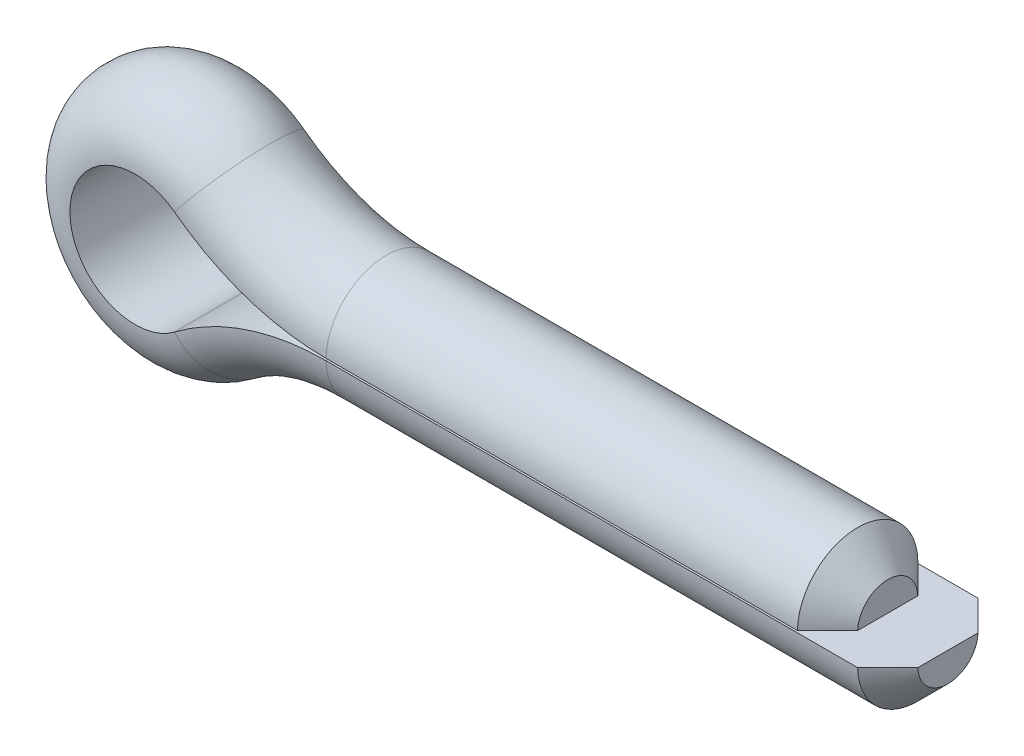
ISO-10303-21;
HEADER;
FILE_DESCRIPTION(('STEP AP214'),'2;1');
FILE_NAME('part.step','',(''),(''),'','','');
FILE_SCHEMA(('AUTOMOTIVE_DESIGN { 1 0 10303 214 1 1 1 1 }'));
ENDSEC;
DATA;
#1=APPLICATION_CONTEXT('core data for automotive mechanical design processes');
#2=APPLICATION_PROTOCOL_DEFINITION('international standard','automotive_design',2000,#1);
#3=PRODUCT_CONTEXT('',#1,'mechanical');
#4=PRODUCT('Part','Part','',(#3));
#5=PRODUCT_RELATED_PRODUCT_CATEGORY('part','',(#4));
#6=PRODUCT_DEFINITION_FORMATION('','',#4);
#7=PRODUCT_DEFINITION_CONTEXT('part definition',#1,'design');
#8=PRODUCT_DEFINITION('design','',#6,#7);
#9=PRODUCT_DEFINITION_SHAPE('','',#8);
#10=(LENGTH_UNIT() NAMED_UNIT(*) SI_UNIT(.MILLI.,.METRE.));
#11=(NAMED_UNIT(*) PLANE_ANGLE_UNIT() SI_UNIT($,.RADIAN.));
#12=(NAMED_UNIT(*) SI_UNIT($,.STERADIAN.) SOLID_ANGLE_UNIT());
#13=UNCERTAINTY_MEASURE_WITH_UNIT(LENGTH_MEASURE(1.E-05),#10,'distance_accuracy_value','');
#14=(GEOMETRIC_REPRESENTATION_CONTEXT(3) GLOBAL_UNCERTAINTY_ASSIGNED_CONTEXT((#13)) GLOBAL_UNIT_ASSIGNED_CONTEXT((#10,
#11,#12)) REPRESENTATION_CONTEXT('',''));
#15=CARTESIAN_POINT('',(0.,0.,0.));
#16=DIRECTION('',(0.,0.,1.));
#17=DIRECTION('',(1.,0.,0.));
#18=AXIS2_PLACEMENT_3D('',#15,#16,#17);
#19=CARTESIAN_POINT('',(1.524,0.,0.));
#20=DIRECTION('',(-1.,0.,0.));
#21=DIRECTION('',(0.,0.,-1.));
#22=AXIS2_PLACEMENT_3D('',#19,#20,#21);
#23=PLANE('',#22);
#24=DIRECTION('',(0.,0.,-1.));
#25=VECTOR('',#24,1.);
#26=CARTESIAN_POINT('',(1.524,-0.0254,1.52378831863222));
#27=LINE('',#26,#25);
#28=CARTESIAN_POINT('',(1.524,-0.0253999999999999,0.761576549008695));
#29=VERTEX_POINT('',#28);
#30=CARTESIAN_POINT('',(1.524,-0.0253999999999998,-0.761576549008695));
#31=VERTEX_POINT('',#30);
#32=EDGE_CURVE('E138',#29,#31,#27,.T.);
#33=ORIENTED_EDGE('',*,*,#32,.F.);
#34=CARTESIAN_POINT('',(1.524,0.,0.));
#35=DIRECTION('',(-1.,0.,0.));
#36=DIRECTION('',(0.,-1.,0.));
#37=AXIS2_PLACEMENT_3D('',#34,#35,#36);
#38=CIRCLE('',#37,0.761999999999996);
#39=EDGE_CURVE('E249',#29,#31,#38,.F.);
#40=ORIENTED_EDGE('',*,*,#39,.T.);
#41=EDGE_LOOP('',(#33,#40));
#42=FACE_BOUND('',#41,.T.);
#43=ADVANCED_FACE('F60',(#42),#23,.F.);
#44=CARTESIAN_POINT('',(0.,0.,0.));
#45=DIRECTION('',(1.,0.,0.));
#46=DIRECTION('',(0.,0.,-1.));
#47=AXIS2_PLACEMENT_3D('',#44,#45,#46);
#48=PLANE('',#47);
#49=DIRECTION('',(0.,0.,-1.));
#50=VECTOR('',#49,1.);
#51=CARTESIAN_POINT('',(0.,0.0254,1.52378831863222));
#52=LINE('',#51,#50);
#53=CARTESIAN_POINT('',(0.,0.0253999999999999,0.761576549008702));
#54=VERTEX_POINT('',#53);
#55=CARTESIAN_POINT('',(0.,0.0253999999999998,-0.761576549008702));
#56=VERTEX_POINT('',#55);
#57=EDGE_CURVE('E185',#54,#56,#52,.T.);
#58=ORIENTED_EDGE('',*,*,#57,.T.);
#59=CARTESIAN_POINT('',(0.,0.,0.));
#60=DIRECTION('',(1.,0.,0.));
#61=DIRECTION('',(0.,0.,-1.));
#62=AXIS2_PLACEMENT_3D('',#59,#60,#61);
#63=CIRCLE('',#62,0.762000000000002);
#64=EDGE_CURVE('E246',#56,#54,#63,.T.);
#65=ORIENTED_EDGE('',*,*,#64,.T.);
#66=EDGE_LOOP('',(#58,#65));
#67=FACE_BOUND('',#66,.T.);
#68=ADVANCED_FACE('F223',(#67),#48,.T.);
#69=CARTESIAN_POINT('',(1.524,0.,0.));
#70=DIRECTION('',(-1.,0.,0.));
#71=DIRECTION('',(0.,-1.,0.));
#72=AXIS2_PLACEMENT_3D('',#69,#70,#71);
#73=CYLINDRICAL_SURFACE('',#72,1.524);
#74=DIRECTION('',(-1.,0.,0.));
#75=VECTOR('',#74,1.);
#76=CARTESIAN_POINT('',(1.524,-0.0253999999999997,-1.52378831863222));
#77=LINE('',#76,#75);
#78=CARTESIAN_POINT('',(0.761999999999994,-0.0253999999999995,-1.52378831863222));
#79=VERTEX_POINT('',#78);
#80=CARTESIAN_POINT('',(-12.7,-0.0253999999999963,-1.52378831863222));
#81=VERTEX_POINT('',#80);
#82=EDGE_CURVE('E123',#79,#81,#77,.T.);
#83=ORIENTED_EDGE('',*,*,#82,.F.);
#84=CARTESIAN_POINT('',(0.761999999999994,0.,0.));
#85=DIRECTION('',(-1.,0.,0.));
#86=DIRECTION('',(0.,-1.,0.));
#87=AXIS2_PLACEMENT_3D('',#84,#85,#86);
#88=CIRCLE('',#87,1.524);
#89=CARTESIAN_POINT('',(0.761999999999994,-0.0253999999999998,1.52378831863222));
#90=VERTEX_POINT('',#89);
#91=EDGE_CURVE('E197',#79,#90,#88,.T.);
#92=ORIENTED_EDGE('',*,*,#91,.T.);
#93=DIRECTION('',(-1.,0.,0.));
#94=VECTOR('',#93,1.);
#95=CARTESIAN_POINT('',(1.524,-0.0254,1.52378831863222));
#96=LINE('',#95,#94);
#97=CARTESIAN_POINT('',(-12.7,-0.0253999999999966,1.52378831863222));
#98=VERTEX_POINT('',#97);
#99=EDGE_CURVE('E154',#90,#98,#96,.T.);
#100=ORIENTED_EDGE('',*,*,#99,.T.);
#101=CARTESIAN_POINT('',(-12.7,0.,0.));
#102=DIRECTION('',(-1.,0.,0.));
#103=DIRECTION('',(0.,0.,-1.));
#104=AXIS2_PLACEMENT_3D('',#101,#102,#103);
#105=CIRCLE('',#104,1.524);
#106=EDGE_CURVE('E137',#81,#98,#105,.T.);
#107=ORIENTED_EDGE('',*,*,#106,.F.);
#108=EDGE_LOOP('',(#83,#92,#100,#107));
#109=FACE_BOUND('',#108,.T.);
#110=ADVANCED_FACE('F156',(#109),#73,.T.);
#111=CARTESIAN_POINT('',(1.524,-0.0254,1.52378831863222));
#112=DIRECTION('',(0.,1.,0.));
#113=DIRECTION('',(-1.,0.,0.));
#114=AXIS2_PLACEMENT_3D('',#111,#112,#113);
#115=PLANE('',#114);
#116=ORIENTED_EDGE('',*,*,#99,.F.);
#117=CARTESIAN_POINT('',(0.761999999999994,-0.0253999999999998,1.52378831863222));
#118=CARTESIAN_POINT('',(0.889011769792723,-0.0253999999999998,1.39676479039933));
#119=CARTESIAN_POINT('',(1.01601765464367,-0.0253999999999999,1.2697353788597));
#120=CARTESIAN_POINT('',(1.27001765464368,-0.0253999999999999,1.01566478898521));
#121=CARTESIAN_POINT('',(1.39701176979274,-0.0253999999999999,0.888623610650329));
#122=CARTESIAN_POINT('',(1.524,-0.0253999999999999,0.761576549008695));
#123=B_SPLINE_CURVE_WITH_KNOTS('',3,(#117,#118,#119,#120,#121,#122),.UNSPECIFIED.,.F.,.F.,(4,2,
4),(0.,0.538890244526547,1.0777804898241),.UNSPECIFIED.);
#124=EDGE_CURVE('E205',#90,#29,#123,.T.);
#125=ORIENTED_EDGE('',*,*,#124,.T.);
#126=ORIENTED_EDGE('',*,*,#32,.T.);
#127=CARTESIAN_POINT('',(1.524,-0.0253999999999998,-0.761576549008695));
#128=CARTESIAN_POINT('',(1.31362474173232,-0.0253999999999997,-0.972042265569015));
#129=CARTESIAN_POINT('',(1.10323623399388,-0.0253999999999996,-1.18249473567864));
#130=CARTESIAN_POINT('',(0.849223553756497,-0.0253999999999995,-1.43655264820608));
#131=CARTESIAN_POINT('',(0.805612061494938,-0.0253999999999995,-1.48017076797097));
#132=CARTESIAN_POINT('',(0.761999999999994,-0.0253999999999995,-1.52378831863222));
#133=B_SPLINE_CURVE_WITH_KNOTS('',3,(#127,#128,#129,#130,#131,#132),.UNSPECIFIED.,.F.,.F.,(4,2,
4),(0.,0.89273853802379,1.07778048911039),.UNSPECIFIED.);
#134=EDGE_CURVE('E132',#31,#79,#133,.T.);
#135=ORIENTED_EDGE('',*,*,#134,.T.);
#136=ORIENTED_EDGE('',*,*,#82,.T.);
#137=DIRECTION('',(0.,0.,-1.));
#138=VECTOR('',#137,1.);
#139=CARTESIAN_POINT('',(-12.7,-0.0253999999999966,1.52378831863222));
#140=LINE('',#139,#138);
#141=EDGE_CURVE('E128',#98,#81,#140,.T.);
#142=ORIENTED_EDGE('',*,*,#141,.F.);
#143=EDGE_LOOP('',(#116,#125,#126,#135,#136,#142));
#144=FACE_BOUND('',#143,.T.);
#145=ADVANCED_FACE('F126',(#144),#115,.T.);
#146=CARTESIAN_POINT('',(-12.7,-6.3754,0.));
#147=DIRECTION('',(0.,0.,1.));
#148=DIRECTION('',(1.,0.,0.));
#149=AXIS2_PLACEMENT_3D('',#146,#147,#148);
#150=TOROIDAL_SURFACE('',#149,6.3754,1.524);
#151=CARTESIAN_POINT('',(-12.7,-6.3754,1.52378831863222));
#152=DIRECTION('',(0.,0.,1.));
#153=DIRECTION('',(0.,1.,0.));
#154=AXIS2_PLACEMENT_3D('',#151,#152,#153);
#155=CIRCLE('',#154,6.35);
#156=CARTESIAN_POINT('',(-16.5367312029918,-1.31555873015873,1.52378831863222));
#157=VERTEX_POINT('',#156);
#158=EDGE_CURVE('E153',#98,#157,#155,.T.);
#159=ORIENTED_EDGE('',*,*,#158,.T.);
#160=CARTESIAN_POINT('',(-16.5520781278038,-1.29531936507936,0.));
#161=DIRECTION('',(-0.796825396825396,-0.604209638266429,0.));
#162=DIRECTION('',(0.,0.,-1.));
#163=AXIS2_PLACEMENT_3D('',#160,#161,#162);
#164=CIRCLE('',#163,1.524);
#165=CARTESIAN_POINT('',(-16.5367312029918,-1.31555873015873,-1.52378831863222));
#166=VERTEX_POINT('',#165);
#167=EDGE_CURVE('E147',#166,#157,#164,.T.);
#168=ORIENTED_EDGE('',*,*,#167,.F.);
#169=CARTESIAN_POINT('',(-12.7,-6.3754,-1.52378831863222));
#170=DIRECTION('',(0.,0.,1.));
#171=DIRECTION('',(0.,1.,0.));
#172=AXIS2_PLACEMENT_3D('',#169,#170,#171);
#173=CIRCLE('',#172,6.35);
#174=EDGE_CURVE('E143',#81,#166,#173,.T.);
#175=ORIENTED_EDGE('',*,*,#174,.F.);
#176=ORIENTED_EDGE('',*,*,#106,.T.);
#177=EDGE_LOOP('',(#159,#168,#175,#176));
#178=FACE_BOUND('',#177,.T.);
#179=ADVANCED_FACE('F145',(#178),#150,.T.);
#180=CARTESIAN_POINT('',(-12.7,-6.3754,0.));
#181=DIRECTION('',(0.,0.,1.));
#182=DIRECTION('',(1.,0.,0.));
#183=AXIS2_PLACEMENT_3D('',#180,#181,#182);
#184=CYLINDRICAL_SURFACE('',#183,6.35);
#185=DIRECTION('',(0.,0.,-1.));
#186=VECTOR('',#185,1.);
#187=CARTESIAN_POINT('',(-16.5367312029918,-1.31555873015873,1.52378831863222));
#188=LINE('',#187,#186);
#189=EDGE_CURVE('E161',#157,#166,#188,.T.);
#190=ORIENTED_EDGE('',*,*,#189,.F.);
#191=ORIENTED_EDGE('',*,*,#158,.F.);
#192=ORIENTED_EDGE('',*,*,#141,.T.);
#193=ORIENTED_EDGE('',*,*,#174,.T.);
#194=EDGE_LOOP('',(#190,#191,#192,#193));
#195=FACE_BOUND('',#194,.T.);
#196=ADVANCED_FACE('F152',(#195),#184,.T.);
#197=CARTESIAN_POINT('',(-17.5342813157697,0.,0.));
#198=DIRECTION('',(0.,0.,-1.));
#199=DIRECTION('',(-1.,0.,0.));
#200=AXIS2_PLACEMENT_3D('',#197,#198,#199);
#201=TOROIDAL_SURFACE('',#200,1.6256,1.524);
#202=CARTESIAN_POINT('',(-17.5342813157697,0.,1.52378831863222));
#203=DIRECTION('',(0.,0.,-1.));
#204=DIRECTION('',(0.604209638266428,-0.796825396825398,0.));
#205=AXIS2_PLACEMENT_3D('',#202,#203,#204);
#206=CIRCLE('',#205,1.651);
#207=CARTESIAN_POINT('',(-16.5367312029918,1.31555873015873,1.52378831863222));
#208=VERTEX_POINT('',#207);
#209=EDGE_CURVE('E166',#157,#208,#206,.T.);
#210=ORIENTED_EDGE('',*,*,#209,.T.);
#211=CARTESIAN_POINT('',(-16.5520781278038,1.29531936507936,0.));
#212=DIRECTION('',(0.796825396825398,-0.604209638266428,0.));
#213=DIRECTION('',(0.,0.,-1.));
#214=AXIS2_PLACEMENT_3D('',#211,#212,#213);
#215=CIRCLE('',#214,1.524);
#216=CARTESIAN_POINT('',(-16.5367312029918,1.31555873015873,-1.52378831863222));
#217=VERTEX_POINT('',#216);
#218=EDGE_CURVE('E163',#217,#208,#215,.T.);
#219=ORIENTED_EDGE('',*,*,#218,.F.);
#220=CARTESIAN_POINT('',(-17.5342813157697,0.,-1.52378831863222));
#221=DIRECTION('',(0.,0.,-1.));
#222=DIRECTION('',(0.604209638266428,-0.796825396825398,0.));
#223=AXIS2_PLACEMENT_3D('',#220,#221,#222);
#224=CIRCLE('',#223,1.651);
#225=EDGE_CURVE('E167',#166,#217,#224,.T.);
#226=ORIENTED_EDGE('',*,*,#225,.F.);
#227=ORIENTED_EDGE('',*,*,#167,.T.);
#228=EDGE_LOOP('',(#210,#219,#226,#227));
#229=FACE_BOUND('',#228,.T.);
#230=ADVANCED_FACE('F293',(#229),#201,.T.);
#231=CARTESIAN_POINT('',(-17.5342813157697,0.,0.));
#232=DIRECTION('',(0.,0.,-1.));
#233=DIRECTION('',(-1.,0.,0.));
#234=AXIS2_PLACEMENT_3D('',#231,#232,#233);
#235=CYLINDRICAL_SURFACE('',#234,1.651);
#236=DIRECTION('',(0.,0.,-1.));
#237=VECTOR('',#236,1.);
#238=CARTESIAN_POINT('',(-16.5367312029918,1.31555873015873,1.52378831863222));
#239=LINE('',#238,#237);
#240=EDGE_CURVE('E170',#208,#217,#239,.T.);
#241=ORIENTED_EDGE('',*,*,#240,.F.);
#242=ORIENTED_EDGE('',*,*,#209,.F.);
#243=ORIENTED_EDGE('',*,*,#189,.T.);
#244=ORIENTED_EDGE('',*,*,#225,.T.);
#245=EDGE_LOOP('',(#241,#242,#243,#244));
#246=FACE_BOUND('',#245,.T.);
#247=ADVANCED_FACE('F285',(#246),#235,.F.);
#248=CARTESIAN_POINT('',(-12.7,6.3754,0.));
#249=DIRECTION('',(0.,0.,1.));
#250=DIRECTION('',(1.,0.,0.));
#251=AXIS2_PLACEMENT_3D('',#248,#249,#250);
#252=TOROIDAL_SURFACE('',#251,6.3754,1.524);
#253=CARTESIAN_POINT('',(-12.7,6.3754,1.52378831863222));
#254=DIRECTION('',(0.,0.,1.));
#255=DIRECTION('',(-0.60420963826643,-0.796825396825396,0.));
#256=AXIS2_PLACEMENT_3D('',#253,#254,#255);
#257=CIRCLE('',#256,6.35);
#258=CARTESIAN_POINT('',(-12.7,0.0253999999999957,1.52378831863222));
#259=VERTEX_POINT('',#258);
#260=EDGE_CURVE('E176',#208,#259,#257,.T.);
#261=ORIENTED_EDGE('',*,*,#260,.T.);
#262=CARTESIAN_POINT('',(-12.7,0.,0.));
#263=DIRECTION('',(1.,0.,0.));
#264=DIRECTION('',(0.,0.,-1.));
#265=AXIS2_PLACEMENT_3D('',#262,#263,#264);
#266=CIRCLE('',#265,1.524);
#267=CARTESIAN_POINT('',(-12.7,0.0253999999999957,-1.52378831863222));
#268=VERTEX_POINT('',#267);
#269=EDGE_CURVE('E173',#268,#259,#266,.T.);
#270=ORIENTED_EDGE('',*,*,#269,.F.);
#271=CARTESIAN_POINT('',(-12.7,6.3754,-1.52378831863222));
#272=DIRECTION('',(0.,0.,1.));
#273=DIRECTION('',(-0.60420963826643,-0.796825396825396,0.));
#274=AXIS2_PLACEMENT_3D('',#271,#272,#273);
#275=CIRCLE('',#274,6.35);
#276=EDGE_CURVE('E177',#217,#268,#275,.T.);
#277=ORIENTED_EDGE('',*,*,#276,.F.);
#278=ORIENTED_EDGE('',*,*,#218,.T.);
#279=EDGE_LOOP('',(#261,#270,#277,#278));
#280=FACE_BOUND('',#279,.T.);
#281=ADVANCED_FACE('F277',(#280),#252,.T.);
#282=CARTESIAN_POINT('',(-12.7,6.3754,0.));
#283=DIRECTION('',(0.,0.,1.));
#284=DIRECTION('',(1.,0.,0.));
#285=AXIS2_PLACEMENT_3D('',#282,#283,#284);
#286=CYLINDRICAL_SURFACE('',#285,6.35);
#287=DIRECTION('',(0.,0.,-1.));
#288=VECTOR('',#287,1.);
#289=CARTESIAN_POINT('',(-12.7,0.0253999999999966,1.52378831863222));
#290=LINE('',#289,#288);
#291=EDGE_CURVE('E180',#259,#268,#290,.T.);
#292=ORIENTED_EDGE('',*,*,#291,.F.);
#293=ORIENTED_EDGE('',*,*,#260,.F.);
#294=ORIENTED_EDGE('',*,*,#240,.T.);
#295=ORIENTED_EDGE('',*,*,#276,.T.);
#296=EDGE_LOOP('',(#292,#293,#294,#295));
#297=FACE_BOUND('',#296,.T.);
#298=ADVANCED_FACE('F232',(#297),#286,.T.);
#299=CARTESIAN_POINT('',(-12.7,0.,0.));
#300=DIRECTION('',(1.,0.,0.));
#301=DIRECTION('',(0.,1.,0.));
#302=AXIS2_PLACEMENT_3D('',#299,#300,#301);
#303=CYLINDRICAL_SURFACE('',#302,1.524);
#304=DIRECTION('',(1.,0.,0.));
#305=VECTOR('',#304,1.);
#306=CARTESIAN_POINT('',(-12.7,0.0253999999999983,1.52378831863222));
#307=LINE('',#306,#305);
#308=CARTESIAN_POINT('',(-0.762000000000001,0.0253999999999999,1.52378831863222));
#309=VERTEX_POINT('',#308);
#310=EDGE_CURVE('E183',#259,#309,#307,.T.);
#311=ORIENTED_EDGE('',*,*,#310,.T.);
#312=CARTESIAN_POINT('',(-0.762000000000001,0.,0.));
#313=DIRECTION('',(1.,0.,0.));
#314=DIRECTION('',(0.,1.,0.));
#315=AXIS2_PLACEMENT_3D('',#312,#313,#314);
#316=CIRCLE('',#315,1.524);
#317=CARTESIAN_POINT('',(-0.762000000000001,0.0253999999999996,-1.52378831863222));
#318=VERTEX_POINT('',#317);
#319=EDGE_CURVE('E12',#309,#318,#316,.F.);
#320=ORIENTED_EDGE('',*,*,#319,.T.);
#321=DIRECTION('',(1.,0.,0.));
#322=VECTOR('',#321,1.);
#323=CARTESIAN_POINT('',(-12.7,0.025399999999998,-1.52378831863222));
#324=LINE('',#323,#322);
#325=EDGE_CURVE('E186',#268,#318,#324,.T.);
#326=ORIENTED_EDGE('',*,*,#325,.F.);
#327=ORIENTED_EDGE('',*,*,#269,.T.);
#328=EDGE_LOOP('',(#311,#320,#326,#327));
#329=FACE_BOUND('',#328,.T.);
#330=ADVANCED_FACE('F231',(#329),#303,.T.);
#331=CARTESIAN_POINT('',(-12.7,0.0253999999999983,1.52378831863222));
#332=DIRECTION('',(0.,-1.,0.));
#333=DIRECTION('',(1.,0.,0.));
#334=AXIS2_PLACEMENT_3D('',#331,#332,#333);
#335=PLANE('',#334);
#336=ORIENTED_EDGE('',*,*,#57,.F.);
#337=CARTESIAN_POINT('',(0.,0.0253999999999999,0.761576549008702));
#338=CARTESIAN_POINT('',(-0.21037525826768,0.0253999999999999,0.972042265569023));
#339=CARTESIAN_POINT('',(-0.420763766006125,0.0253999999999999,1.18249473567865));
#340=CARTESIAN_POINT('',(-0.674776446243504,0.0253999999999999,1.43655264820609));
#341=CARTESIAN_POINT('',(-0.71838793850506,0.0253999999999999,1.48017076797097));
#342=CARTESIAN_POINT('',(-0.762000000000001,0.0253999999999999,1.52378831863222));
#343=B_SPLINE_CURVE_WITH_KNOTS('',3,(#337,#338,#339,#340,#341,#342),.UNSPECIFIED.,.F.,.F.,(4,2,
4),(0.,0.892738538023799,1.07778048911038),.UNSPECIFIED.);
#344=EDGE_CURVE('E69',#54,#309,#343,.T.);
#345=ORIENTED_EDGE('',*,*,#344,.T.);
#346=ORIENTED_EDGE('',*,*,#310,.F.);
#347=ORIENTED_EDGE('',*,*,#291,.T.);
#348=ORIENTED_EDGE('',*,*,#325,.T.);
#349=CARTESIAN_POINT('',(-0.762000000000001,0.0253999999999996,-1.52378831863222));
#350=CARTESIAN_POINT('',(-0.634988230207272,0.0253999999999996,-1.39676479039933));
#351=CARTESIAN_POINT('',(-0.507982345356329,0.0253999999999996,-1.2697353788597));
#352=CARTESIAN_POINT('',(-0.253982345356312,0.0253999999999997,-1.01566478898521));
#353=CARTESIAN_POINT('',(-0.126988230207255,0.0253999999999997,-0.888623610650334));
#354=CARTESIAN_POINT('',(0.,0.0253999999999998,-0.761576549008702));
#355=B_SPLINE_CURVE_WITH_KNOTS('',3,(#349,#350,#351,#352,#353,#354),.UNSPECIFIED.,.F.,.F.,(4,2,
4),(0.,0.538890244526544,1.07778048982409),.UNSPECIFIED.);
#356=EDGE_CURVE('E236',#318,#56,#355,.T.);
#357=ORIENTED_EDGE('',*,*,#356,.T.);
#358=EDGE_LOOP('',(#336,#345,#346,#347,#348,#357));
#359=FACE_BOUND('',#358,.T.);
#360=ADVANCED_FACE('F218',(#359),#335,.T.);
#361=CARTESIAN_POINT('',(0.761999999999994,0.,0.));
#362=DIRECTION('',(-1.,0.,0.));
#363=DIRECTION('',(0.,-1.,0.));
#364=AXIS2_PLACEMENT_3D('',#361,#362,#363);
#365=CONICAL_SURFACE('',#364,1.524,0.785398163397449);
#366=ORIENTED_EDGE('',*,*,#134,.F.);
#367=ORIENTED_EDGE('',*,*,#39,.F.);
#368=ORIENTED_EDGE('',*,*,#124,.F.);
#369=ORIENTED_EDGE('',*,*,#91,.F.);
#370=EDGE_LOOP('',(#366,#367,#368,#369));
#371=FACE_BOUND('',#370,.T.);
#372=ADVANCED_FACE('F214',(#371),#365,.T.);
#373=CARTESIAN_POINT('',(0.,0.,0.));
#374=DIRECTION('',(-1.,0.,0.));
#375=DIRECTION('',(0.,-1.,0.));
#376=AXIS2_PLACEMENT_3D('',#373,#374,#375);
#377=CONICAL_SURFACE('',#376,0.762000000000002,0.785398163397447);
#378=ORIENTED_EDGE('',*,*,#356,.F.);
#379=ORIENTED_EDGE('',*,*,#319,.F.);
#380=ORIENTED_EDGE('',*,*,#344,.F.);
#381=ORIENTED_EDGE('',*,*,#64,.F.);
#382=EDGE_LOOP('',(#378,#379,#380,#381));
#383=FACE_BOUND('',#382,.T.);
#384=ADVANCED_FACE('F62',(#383),#377,.T.);
#385=CLOSED_SHELL('',(#43,#68,#110,#145,#179,#196,#230,#247,#281,#298,#330,#360,#372,#384));
#386=MANIFOLD_SOLID_BREP('B2',#385);
#387=ADVANCED_BREP_SHAPE_REPRESENTATION('',(#18,#386),#14);
#388=SHAPE_DEFINITION_REPRESENTATION(#9,#387);
ENDSEC;
END-ISO-10303-21;
